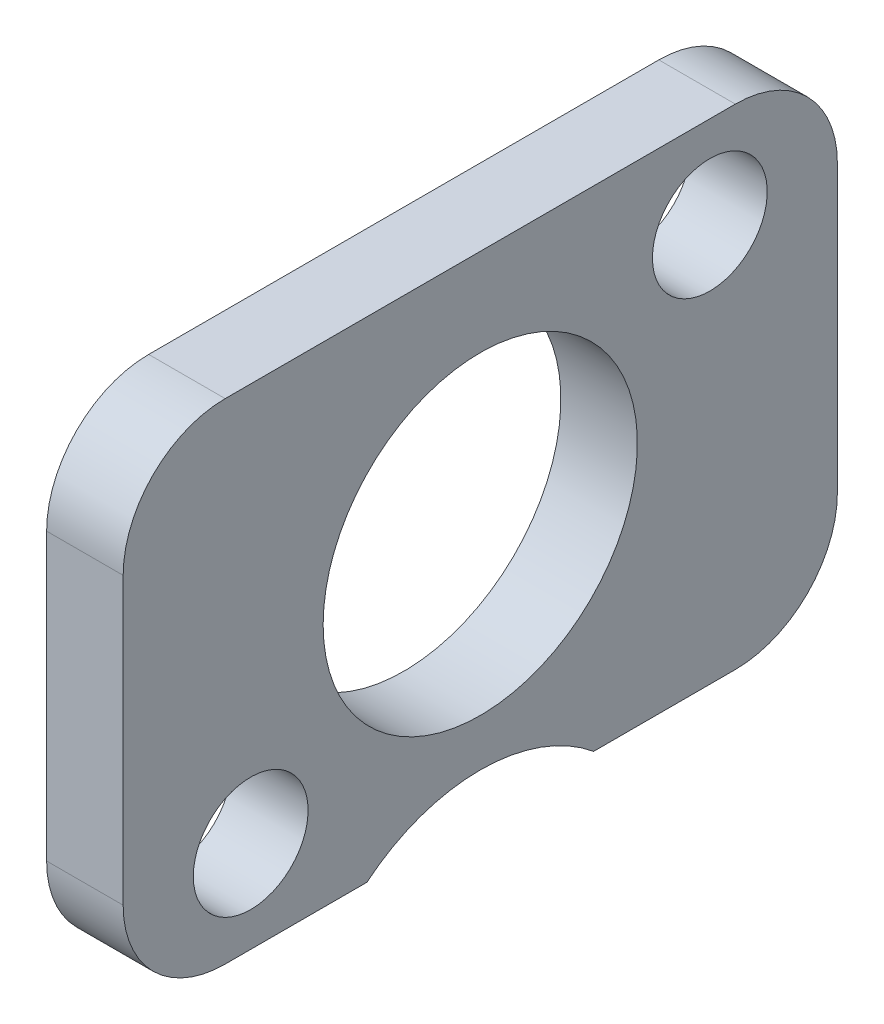
ISO-10303-21;
HEADER;
FILE_DESCRIPTION(('STEP AP214'),'2;1');
FILE_NAME('part.step','',(''),(''),'','','');
FILE_SCHEMA(('AUTOMOTIVE_DESIGN { 1 0 10303 214 1 1 1 1 }'));
ENDSEC;
DATA;
#1=APPLICATION_CONTEXT('core data for automotive mechanical design processes');
#2=APPLICATION_PROTOCOL_DEFINITION('international standard','automotive_design',2000,#1);
#3=PRODUCT_CONTEXT('',#1,'mechanical');
#4=PRODUCT('Part','Part','',(#3));
#5=PRODUCT_RELATED_PRODUCT_CATEGORY('part','',(#4));
#6=PRODUCT_DEFINITION_FORMATION('','',#4);
#7=PRODUCT_DEFINITION_CONTEXT('part definition',#1,'design');
#8=PRODUCT_DEFINITION('design','',#6,#7);
#9=PRODUCT_DEFINITION_SHAPE('','',#8);
#10=(LENGTH_UNIT() NAMED_UNIT(*) SI_UNIT(.MILLI.,.METRE.));
#11=(NAMED_UNIT(*) PLANE_ANGLE_UNIT() SI_UNIT($,.RADIAN.));
#12=(NAMED_UNIT(*) SI_UNIT($,.STERADIAN.) SOLID_ANGLE_UNIT());
#13=UNCERTAINTY_MEASURE_WITH_UNIT(LENGTH_MEASURE(1.E-05),#10,'distance_accuracy_value','');
#14=(GEOMETRIC_REPRESENTATION_CONTEXT(3) GLOBAL_UNCERTAINTY_ASSIGNED_CONTEXT((#13)) GLOBAL_UNIT_ASSIGNED_CONTEXT((#10,
#11,#12)) REPRESENTATION_CONTEXT('',''));
#15=CARTESIAN_POINT('',(0.,0.,0.));
#16=DIRECTION('',(0.,0.,1.));
#17=DIRECTION('',(1.,0.,0.));
#18=AXIS2_PLACEMENT_3D('',#15,#16,#17);
#19=CARTESIAN_POINT('',(2.38125,4.445,-7.9375));
#20=DIRECTION('',(-1.,0.,0.));
#21=DIRECTION('',(0.,0.,1.));
#22=AXIS2_PLACEMENT_3D('',#19,#20,#21);
#23=CYLINDRICAL_SURFACE('',#22,3.175);
#24=CARTESIAN_POINT('',(0.,4.445,-7.9375));
#25=DIRECTION('',(-1.,0.,0.));
#26=DIRECTION('',(0.,0.,1.));
#27=AXIS2_PLACEMENT_3D('',#24,#25,#26);
#28=CIRCLE('',#27,3.175);
#29=CARTESIAN_POINT('',(0.,7.62,-7.9375));
#30=VERTEX_POINT('',#29);
#31=CARTESIAN_POINT('',(0.,4.445,-11.1125));
#32=VERTEX_POINT('',#31);
#33=EDGE_CURVE('E436',#30,#32,#28,.T.);
#34=ORIENTED_EDGE('',*,*,#33,.F.);
#35=DIRECTION('',(-1.,0.,0.));
#36=VECTOR('',#35,1.);
#37=CARTESIAN_POINT('',(2.38125,7.62,-7.9375));
#38=LINE('',#37,#36);
#39=CARTESIAN_POINT('',(2.38125,7.62,-7.9375));
#40=VERTEX_POINT('',#39);
#41=EDGE_CURVE('E11',#40,#30,#38,.T.);
#42=ORIENTED_EDGE('',*,*,#41,.F.);
#43=CARTESIAN_POINT('',(2.38125,4.445,-7.9375));
#44=DIRECTION('',(-1.,0.,0.));
#45=DIRECTION('',(0.,0.,1.));
#46=AXIS2_PLACEMENT_3D('',#43,#44,#45);
#47=CIRCLE('',#46,3.175);
#48=CARTESIAN_POINT('',(2.38125,4.445,-11.1125));
#49=VERTEX_POINT('',#48);
#50=EDGE_CURVE('E438',#40,#49,#47,.T.);
#51=ORIENTED_EDGE('',*,*,#50,.T.);
#52=DIRECTION('',(-1.,0.,0.));
#53=VECTOR('',#52,1.);
#54=CARTESIAN_POINT('',(2.38125,4.445,-11.1125));
#55=LINE('',#54,#53);
#56=EDGE_CURVE('E363',#49,#32,#55,.T.);
#57=ORIENTED_EDGE('',*,*,#56,.T.);
#58=EDGE_LOOP('',(#34,#42,#51,#57));
#59=FACE_BOUND('',#58,.T.);
#60=ADVANCED_FACE('F360',(#59),#23,.T.);
#61=CARTESIAN_POINT('',(2.38125,7.62,7.9375));
#62=DIRECTION('',(0.,1.,0.));
#63=DIRECTION('',(0.,0.,1.));
#64=AXIS2_PLACEMENT_3D('',#61,#62,#63);
#65=PLANE('',#64);
#66=DIRECTION('',(0.,0.,-1.));
#67=VECTOR('',#66,1.);
#68=CARTESIAN_POINT('',(0.,7.62,7.9375));
#69=LINE('',#68,#67);
#70=CARTESIAN_POINT('',(0.,7.62,7.9375));
#71=VERTEX_POINT('',#70);
#72=EDGE_CURVE('E454',#71,#30,#69,.T.);
#73=ORIENTED_EDGE('',*,*,#72,.F.);
#74=DIRECTION('',(-1.,0.,0.));
#75=VECTOR('',#74,1.);
#76=CARTESIAN_POINT('',(2.38125,7.62,7.9375));
#77=LINE('',#76,#75);
#78=CARTESIAN_POINT('',(2.38125,7.62,7.9375));
#79=VERTEX_POINT('',#78);
#80=EDGE_CURVE('E368',#79,#71,#77,.T.);
#81=ORIENTED_EDGE('',*,*,#80,.F.);
#82=DIRECTION('',(0.,0.,-1.));
#83=VECTOR('',#82,1.);
#84=CARTESIAN_POINT('',(2.38125,7.62,7.9375));
#85=LINE('',#84,#83);
#86=EDGE_CURVE('E443',#79,#40,#85,.T.);
#87=ORIENTED_EDGE('',*,*,#86,.T.);
#88=ORIENTED_EDGE('',*,*,#41,.T.);
#89=EDGE_LOOP('',(#73,#81,#87,#88));
#90=FACE_BOUND('',#89,.T.);
#91=ADVANCED_FACE('F547',(#90),#65,.T.);
#92=CARTESIAN_POINT('',(2.38125,4.445,7.9375));
#93=DIRECTION('',(-1.,0.,0.));
#94=DIRECTION('',(0.,0.,1.));
#95=AXIS2_PLACEMENT_3D('',#92,#93,#94);
#96=CYLINDRICAL_SURFACE('',#95,3.175);
#97=CARTESIAN_POINT('',(0.,4.445,7.9375));
#98=DIRECTION('',(-1.,0.,0.));
#99=DIRECTION('',(0.,0.,1.));
#100=AXIS2_PLACEMENT_3D('',#97,#98,#99);
#101=CIRCLE('',#100,3.175);
#102=CARTESIAN_POINT('',(0.,4.445,11.1125));
#103=VERTEX_POINT('',#102);
#104=EDGE_CURVE('E478',#103,#71,#101,.T.);
#105=ORIENTED_EDGE('',*,*,#104,.F.);
#106=DIRECTION('',(-1.,0.,0.));
#107=VECTOR('',#106,1.);
#108=CARTESIAN_POINT('',(2.38125,4.445,11.1125));
#109=LINE('',#108,#107);
#110=CARTESIAN_POINT('',(2.38125,4.445,11.1125));
#111=VERTEX_POINT('',#110);
#112=EDGE_CURVE('E506',#111,#103,#109,.T.);
#113=ORIENTED_EDGE('',*,*,#112,.F.);
#114=CARTESIAN_POINT('',(2.38125,4.445,7.9375));
#115=DIRECTION('',(-1.,0.,0.));
#116=DIRECTION('',(0.,0.,1.));
#117=AXIS2_PLACEMENT_3D('',#114,#115,#116);
#118=CIRCLE('',#117,3.175);
#119=EDGE_CURVE('E502',#111,#79,#118,.T.);
#120=ORIENTED_EDGE('',*,*,#119,.T.);
#121=ORIENTED_EDGE('',*,*,#80,.T.);
#122=EDGE_LOOP('',(#105,#113,#120,#121));
#123=FACE_BOUND('',#122,.T.);
#124=ADVANCED_FACE('F543',(#123),#96,.T.);
#125=CARTESIAN_POINT('',(2.38125,-4.445,11.1125));
#126=DIRECTION('',(0.,0.,1.));
#127=DIRECTION('',(0.,-1.,0.));
#128=AXIS2_PLACEMENT_3D('',#125,#126,#127);
#129=PLANE('',#128);
#130=DIRECTION('',(0.,1.,0.));
#131=VECTOR('',#130,1.);
#132=CARTESIAN_POINT('',(0.,-4.445,11.1125));
#133=LINE('',#132,#131);
#134=CARTESIAN_POINT('',(0.,-4.445,11.1125));
#135=VERTEX_POINT('',#134);
#136=EDGE_CURVE('E475',#135,#103,#133,.T.);
#137=ORIENTED_EDGE('',*,*,#136,.F.);
#138=DIRECTION('',(-1.,0.,0.));
#139=VECTOR('',#138,1.);
#140=CARTESIAN_POINT('',(2.38125,-4.445,11.1125));
#141=LINE('',#140,#139);
#142=CARTESIAN_POINT('',(2.38125,-4.445,11.1125));
#143=VERTEX_POINT('',#142);
#144=EDGE_CURVE('E508',#143,#135,#141,.T.);
#145=ORIENTED_EDGE('',*,*,#144,.F.);
#146=DIRECTION('',(0.,1.,0.));
#147=VECTOR('',#146,1.);
#148=CARTESIAN_POINT('',(2.38125,-4.445,11.1125));
#149=LINE('',#148,#147);
#150=EDGE_CURVE('E499',#143,#111,#149,.T.);
#151=ORIENTED_EDGE('',*,*,#150,.T.);
#152=ORIENTED_EDGE('',*,*,#112,.T.);
#153=EDGE_LOOP('',(#137,#145,#151,#152));
#154=FACE_BOUND('',#153,.T.);
#155=ADVANCED_FACE('F539',(#154),#129,.T.);
#156=CARTESIAN_POINT('',(2.38125,-4.445,7.9375));
#157=DIRECTION('',(-1.,0.,0.));
#158=DIRECTION('',(0.,0.,1.));
#159=AXIS2_PLACEMENT_3D('',#156,#157,#158);
#160=CYLINDRICAL_SURFACE('',#159,3.175);
#161=CARTESIAN_POINT('',(0.,-4.445,7.9375));
#162=DIRECTION('',(-1.,0.,0.));
#163=DIRECTION('',(0.,0.,-1.));
#164=AXIS2_PLACEMENT_3D('',#161,#162,#163);
#165=CIRCLE('',#164,3.175);
#166=CARTESIAN_POINT('',(0.,-7.62,7.9375));
#167=VERTEX_POINT('',#166);
#168=EDGE_CURVE('E472',#167,#135,#165,.T.);
#169=ORIENTED_EDGE('',*,*,#168,.F.);
#170=DIRECTION('',(-1.,0.,0.));
#171=VECTOR('',#170,1.);
#172=CARTESIAN_POINT('',(2.38125,-7.62,7.9375));
#173=LINE('',#172,#171);
#174=CARTESIAN_POINT('',(2.38125,-7.62,7.9375));
#175=VERTEX_POINT('',#174);
#176=EDGE_CURVE('E510',#175,#167,#173,.T.);
#177=ORIENTED_EDGE('',*,*,#176,.F.);
#178=CARTESIAN_POINT('',(2.38125,-4.445,7.9375));
#179=DIRECTION('',(-1.,0.,0.));
#180=DIRECTION('',(0.,0.,-1.));
#181=AXIS2_PLACEMENT_3D('',#178,#179,#180);
#182=CIRCLE('',#181,3.175);
#183=EDGE_CURVE('E496',#175,#143,#182,.T.);
#184=ORIENTED_EDGE('',*,*,#183,.T.);
#185=ORIENTED_EDGE('',*,*,#144,.T.);
#186=EDGE_LOOP('',(#169,#177,#184,#185));
#187=FACE_BOUND('',#186,.T.);
#188=ADVANCED_FACE('F535',(#187),#160,.T.);
#189=CARTESIAN_POINT('',(2.38125,-7.62,7.9375));
#190=DIRECTION('',(0.,-1.,0.));
#191=DIRECTION('',(0.,0.,-1.));
#192=AXIS2_PLACEMENT_3D('',#189,#190,#191);
#193=PLANE('',#192);
#194=DIRECTION('',(0.,0.,1.));
#195=VECTOR('',#194,1.);
#196=CARTESIAN_POINT('',(0.,-7.62,7.9375));
#197=LINE('',#196,#195);
#198=CARTESIAN_POINT('',(0.,-7.62,3.52781792366047));
#199=VERTEX_POINT('',#198);
#200=EDGE_CURVE('E469',#199,#167,#197,.T.);
#201=ORIENTED_EDGE('',*,*,#200,.F.);
#202=DIRECTION('',(-1.,0.,0.));
#203=VECTOR('',#202,1.);
#204=CARTESIAN_POINT('',(2.38125,-7.62,3.52781792366047));
#205=LINE('',#204,#203);
#206=CARTESIAN_POINT('',(2.38125,-7.62,3.52781792366047));
#207=VERTEX_POINT('',#206);
#208=EDGE_CURVE('E512',#207,#199,#205,.T.);
#209=ORIENTED_EDGE('',*,*,#208,.F.);
#210=DIRECTION('',(0.,0.,1.));
#211=VECTOR('',#210,1.);
#212=CARTESIAN_POINT('',(2.38125,-7.62,7.9375));
#213=LINE('',#212,#211);
#214=EDGE_CURVE('E493',#207,#175,#213,.T.);
#215=ORIENTED_EDGE('',*,*,#214,.T.);
#216=ORIENTED_EDGE('',*,*,#176,.T.);
#217=EDGE_LOOP('',(#201,#209,#215,#216));
#218=FACE_BOUND('',#217,.T.);
#219=ADVANCED_FACE('F531',(#218),#193,.T.);
#220=CARTESIAN_POINT('',(2.38125,-11.9126,0.));
#221=DIRECTION('',(-1.,0.,0.));
#222=DIRECTION('',(0.,0.,1.));
#223=AXIS2_PLACEMENT_3D('',#220,#221,#222);
#224=CYLINDRICAL_SURFACE('',#223,5.55625);
#225=CARTESIAN_POINT('',(0.,-11.9126,0.));
#226=DIRECTION('',(1.,0.,0.));
#227=DIRECTION('',(0.,0.,1.));
#228=AXIS2_PLACEMENT_3D('',#225,#226,#227);
#229=CIRCLE('',#228,5.55625);
#230=CARTESIAN_POINT('',(0.,-7.62,-3.52781792366047));
#231=VERTEX_POINT('',#230);
#232=EDGE_CURVE('E466',#231,#199,#229,.T.);
#233=ORIENTED_EDGE('',*,*,#232,.F.);
#234=DIRECTION('',(-1.,0.,0.));
#235=VECTOR('',#234,1.);
#236=CARTESIAN_POINT('',(2.38125,-7.62,-3.52781792366047));
#237=LINE('',#236,#235);
#238=CARTESIAN_POINT('',(2.38125,-7.62,-3.52781792366047));
#239=VERTEX_POINT('',#238);
#240=EDGE_CURVE('E514',#239,#231,#237,.T.);
#241=ORIENTED_EDGE('',*,*,#240,.F.);
#242=CARTESIAN_POINT('',(2.38125,-11.9126,0.));
#243=DIRECTION('',(1.,0.,0.));
#244=DIRECTION('',(0.,0.,1.));
#245=AXIS2_PLACEMENT_3D('',#242,#243,#244);
#246=CIRCLE('',#245,5.55625);
#247=EDGE_CURVE('E490',#239,#207,#246,.T.);
#248=ORIENTED_EDGE('',*,*,#247,.T.);
#249=ORIENTED_EDGE('',*,*,#208,.T.);
#250=EDGE_LOOP('',(#233,#241,#248,#249));
#251=FACE_BOUND('',#250,.T.);
#252=ADVANCED_FACE('F527',(#251),#224,.F.);
#253=CARTESIAN_POINT('',(2.38125,-7.62,-3.52781792366047));
#254=DIRECTION('',(0.,-1.,0.));
#255=DIRECTION('',(0.,0.,-1.));
#256=AXIS2_PLACEMENT_3D('',#253,#254,#255);
#257=PLANE('',#256);
#258=DIRECTION('',(0.,0.,1.));
#259=VECTOR('',#258,1.);
#260=CARTESIAN_POINT('',(0.,-7.62,-3.52781792366047));
#261=LINE('',#260,#259);
#262=CARTESIAN_POINT('',(0.,-7.62,-7.9375));
#263=VERTEX_POINT('',#262);
#264=EDGE_CURVE('E463',#263,#231,#261,.T.);
#265=ORIENTED_EDGE('',*,*,#264,.F.);
#266=DIRECTION('',(-1.,0.,0.));
#267=VECTOR('',#266,1.);
#268=CARTESIAN_POINT('',(2.38125,-7.62,-7.9375));
#269=LINE('',#268,#267);
#270=CARTESIAN_POINT('',(2.38125,-7.62,-7.9375));
#271=VERTEX_POINT('',#270);
#272=EDGE_CURVE('E516',#271,#263,#269,.T.);
#273=ORIENTED_EDGE('',*,*,#272,.F.);
#274=DIRECTION('',(0.,0.,1.));
#275=VECTOR('',#274,1.);
#276=CARTESIAN_POINT('',(2.38125,-7.62,-3.52781792366047));
#277=LINE('',#276,#275);
#278=EDGE_CURVE('E487',#271,#239,#277,.T.);
#279=ORIENTED_EDGE('',*,*,#278,.T.);
#280=ORIENTED_EDGE('',*,*,#240,.T.);
#281=EDGE_LOOP('',(#265,#273,#279,#280));
#282=FACE_BOUND('',#281,.T.);
#283=ADVANCED_FACE('F523',(#282),#257,.T.);
#284=CARTESIAN_POINT('',(2.38125,-4.445,-7.9375));
#285=DIRECTION('',(-1.,0.,0.));
#286=DIRECTION('',(0.,0.,1.));
#287=AXIS2_PLACEMENT_3D('',#284,#285,#286);
#288=CYLINDRICAL_SURFACE('',#287,3.175);
#289=CARTESIAN_POINT('',(0.,-4.445,-7.9375));
#290=DIRECTION('',(-1.,0.,0.));
#291=DIRECTION('',(0.,0.,1.));
#292=AXIS2_PLACEMENT_3D('',#289,#290,#291);
#293=CIRCLE('',#292,3.175);
#294=CARTESIAN_POINT('',(0.,-4.445,-11.1125));
#295=VERTEX_POINT('',#294);
#296=EDGE_CURVE('E450',#295,#263,#293,.T.);
#297=ORIENTED_EDGE('',*,*,#296,.F.);
#298=DIRECTION('',(-1.,0.,0.));
#299=VECTOR('',#298,1.);
#300=CARTESIAN_POINT('',(2.38125,-4.445,-11.1125));
#301=LINE('',#300,#299);
#302=CARTESIAN_POINT('',(2.38125,-4.445,-11.1125));
#303=VERTEX_POINT('',#302);
#304=EDGE_CURVE('E442',#303,#295,#301,.T.);
#305=ORIENTED_EDGE('',*,*,#304,.F.);
#306=CARTESIAN_POINT('',(2.38125,-4.445,-7.9375));
#307=DIRECTION('',(-1.,0.,0.));
#308=DIRECTION('',(0.,0.,1.));
#309=AXIS2_PLACEMENT_3D('',#306,#307,#308);
#310=CIRCLE('',#309,3.175);
#311=EDGE_CURVE('E484',#303,#271,#310,.T.);
#312=ORIENTED_EDGE('',*,*,#311,.T.);
#313=ORIENTED_EDGE('',*,*,#272,.T.);
#314=EDGE_LOOP('',(#297,#305,#312,#313));
#315=FACE_BOUND('',#314,.T.);
#316=ADVANCED_FACE('F519',(#315),#288,.T.);
#317=CARTESIAN_POINT('',(2.38125,-4.445,-11.1125));
#318=DIRECTION('',(0.,0.,-1.));
#319=DIRECTION('',(0.,1.,0.));
#320=AXIS2_PLACEMENT_3D('',#317,#318,#319);
#321=PLANE('',#320);
#322=DIRECTION('',(0.,-1.,0.));
#323=VECTOR('',#322,1.);
#324=CARTESIAN_POINT('',(0.,-4.445,-11.1125));
#325=LINE('',#324,#323);
#326=EDGE_CURVE('E445',#32,#295,#325,.T.);
#327=ORIENTED_EDGE('',*,*,#326,.F.);
#328=ORIENTED_EDGE('',*,*,#56,.F.);
#329=DIRECTION('',(0.,-1.,0.));
#330=VECTOR('',#329,1.);
#331=CARTESIAN_POINT('',(2.38125,-4.445,-11.1125));
#332=LINE('',#331,#330);
#333=EDGE_CURVE('E482',#49,#303,#332,.T.);
#334=ORIENTED_EDGE('',*,*,#333,.T.);
#335=ORIENTED_EDGE('',*,*,#304,.T.);
#336=EDGE_LOOP('',(#327,#328,#334,#335));
#337=FACE_BOUND('',#336,.T.);
#338=ADVANCED_FACE('F446',(#337),#321,.T.);
#339=CARTESIAN_POINT('',(2.38125,4.445,-7.9375));
#340=DIRECTION('',(-1.,0.,0.));
#341=DIRECTION('',(0.,0.,1.));
#342=AXIS2_PLACEMENT_3D('',#339,#340,#341);
#343=PLANE('',#342);
#344=CARTESIAN_POINT('',(2.38125,-4.7625,7.14375));
#345=DIRECTION('',(-1.,0.,0.));
#346=DIRECTION('',(0.,0.,1.));
#347=AXIS2_PLACEMENT_3D('',#344,#345,#346);
#348=CIRCLE('',#347,1.7859375);
#349=CARTESIAN_POINT('',(2.38125,-4.7625,8.9296875));
#350=VERTEX_POINT('',#349);
#351=EDGE_CURVE('E582',#350,#350,#348,.T.);
#352=ORIENTED_EDGE('',*,*,#351,.T.);
#353=EDGE_LOOP('',(#352));
#354=FACE_BOUND('',#353,.T.);
#355=CARTESIAN_POINT('',(2.38125,4.7625,-7.14375));
#356=DIRECTION('',(-1.,0.,0.));
#357=DIRECTION('',(0.,0.,1.));
#358=AXIS2_PLACEMENT_3D('',#355,#356,#357);
#359=CIRCLE('',#358,1.7859375);
#360=CARTESIAN_POINT('',(2.38125,4.7625,-5.3578125));
#361=VERTEX_POINT('',#360);
#362=EDGE_CURVE('E586',#361,#361,#359,.T.);
#363=ORIENTED_EDGE('',*,*,#362,.T.);
#364=EDGE_LOOP('',(#363));
#365=FACE_BOUND('',#364,.T.);
#366=CARTESIAN_POINT('',(2.38125,0.,0.));
#367=DIRECTION('',(-1.,0.,0.));
#368=DIRECTION('',(0.,0.,1.));
#369=AXIS2_PLACEMENT_3D('',#366,#367,#368);
#370=CIRCLE('',#369,4.8895);
#371=CARTESIAN_POINT('',(2.38125,0.,4.88950000000001));
#372=VERTEX_POINT('',#371);
#373=EDGE_CURVE('E455',#372,#372,#370,.T.);
#374=ORIENTED_EDGE('',*,*,#373,.T.);
#375=EDGE_LOOP('',(#374));
#376=FACE_BOUND('',#375,.T.);
#377=ORIENTED_EDGE('',*,*,#50,.F.);
#378=ORIENTED_EDGE('',*,*,#86,.F.);
#379=ORIENTED_EDGE('',*,*,#119,.F.);
#380=ORIENTED_EDGE('',*,*,#150,.F.);
#381=ORIENTED_EDGE('',*,*,#183,.F.);
#382=ORIENTED_EDGE('',*,*,#214,.F.);
#383=ORIENTED_EDGE('',*,*,#247,.F.);
#384=ORIENTED_EDGE('',*,*,#278,.F.);
#385=ORIENTED_EDGE('',*,*,#311,.F.);
#386=ORIENTED_EDGE('',*,*,#333,.F.);
#387=EDGE_LOOP('',(#377,#378,#379,#380,#381,#382,#383,#384,#385,#386));
#388=FACE_BOUND('',#387,.T.);
#389=ADVANCED_FACE('F546',(#354,#365,#376,#388),#343,.F.);
#390=CARTESIAN_POINT('',(0.,4.445,-7.9375));
#391=DIRECTION('',(-1.,0.,0.));
#392=DIRECTION('',(0.,0.,1.));
#393=AXIS2_PLACEMENT_3D('',#390,#391,#392);
#394=PLANE('',#393);
#395=CARTESIAN_POINT('',(0.,-4.7625,7.14375));
#396=DIRECTION('',(-1.,0.,0.));
#397=DIRECTION('',(0.,0.,1.));
#398=AXIS2_PLACEMENT_3D('',#395,#396,#397);
#399=CIRCLE('',#398,1.7859375);
#400=CARTESIAN_POINT('',(0.,-4.7625,8.9296875));
#401=VERTEX_POINT('',#400);
#402=EDGE_CURVE('E602',#401,#401,#399,.T.);
#403=ORIENTED_EDGE('',*,*,#402,.F.);
#404=EDGE_LOOP('',(#403));
#405=FACE_BOUND('',#404,.T.);
#406=CARTESIAN_POINT('',(0.,4.7625,-7.14375));
#407=DIRECTION('',(-1.,0.,0.));
#408=DIRECTION('',(0.,0.,1.));
#409=AXIS2_PLACEMENT_3D('',#406,#407,#408);
#410=CIRCLE('',#409,1.7859375);
#411=CARTESIAN_POINT('',(0.,4.7625,-5.3578125));
#412=VERTEX_POINT('',#411);
#413=EDGE_CURVE('E596',#412,#412,#410,.T.);
#414=ORIENTED_EDGE('',*,*,#413,.F.);
#415=EDGE_LOOP('',(#414));
#416=FACE_BOUND('',#415,.T.);
#417=CARTESIAN_POINT('',(0.,0.,0.));
#418=DIRECTION('',(-1.,0.,0.));
#419=DIRECTION('',(0.,0.,1.));
#420=AXIS2_PLACEMENT_3D('',#417,#418,#419);
#421=CIRCLE('',#420,4.8895);
#422=CARTESIAN_POINT('',(0.,0.,4.88950000000001));
#423=VERTEX_POINT('',#422);
#424=EDGE_CURVE('E458',#423,#423,#421,.T.);
#425=ORIENTED_EDGE('',*,*,#424,.F.);
#426=EDGE_LOOP('',(#425));
#427=FACE_BOUND('',#426,.T.);
#428=ORIENTED_EDGE('',*,*,#33,.T.);
#429=ORIENTED_EDGE('',*,*,#326,.T.);
#430=ORIENTED_EDGE('',*,*,#296,.T.);
#431=ORIENTED_EDGE('',*,*,#264,.T.);
#432=ORIENTED_EDGE('',*,*,#232,.T.);
#433=ORIENTED_EDGE('',*,*,#200,.T.);
#434=ORIENTED_EDGE('',*,*,#168,.T.);
#435=ORIENTED_EDGE('',*,*,#136,.T.);
#436=ORIENTED_EDGE('',*,*,#104,.T.);
#437=ORIENTED_EDGE('',*,*,#72,.T.);
#438=EDGE_LOOP('',(#428,#429,#430,#431,#432,#433,#434,#435,#436,#437));
#439=FACE_BOUND('',#438,.T.);
#440=ADVANCED_FACE('F452',(#405,#416,#427,#439),#394,.T.);
#441=CARTESIAN_POINT('',(2.38125,0.,0.));
#442=DIRECTION('',(-1.,0.,0.));
#443=DIRECTION('',(0.,0.,1.));
#444=AXIS2_PLACEMENT_3D('',#441,#442,#443);
#445=CYLINDRICAL_SURFACE('',#444,4.8895);
#446=ORIENTED_EDGE('',*,*,#373,.F.);
#447=EDGE_LOOP('',(#446));
#448=FACE_BOUND('',#447,.T.);
#449=ORIENTED_EDGE('',*,*,#424,.T.);
#450=EDGE_LOOP('',(#449));
#451=FACE_BOUND('',#450,.T.);
#452=ADVANCED_FACE('F577',(#448,#451),#445,.F.);
#453=CARTESIAN_POINT('',(2.38125,4.7625,-7.14375));
#454=DIRECTION('',(-1.,0.,0.));
#455=DIRECTION('',(0.,0.,1.));
#456=AXIS2_PLACEMENT_3D('',#453,#454,#455);
#457=CYLINDRICAL_SURFACE('',#456,1.7859375);
#458=ORIENTED_EDGE('',*,*,#362,.F.);
#459=EDGE_LOOP('',(#458));
#460=FACE_BOUND('',#459,.T.);
#461=ORIENTED_EDGE('',*,*,#413,.T.);
#462=EDGE_LOOP('',(#461));
#463=FACE_BOUND('',#462,.T.);
#464=ADVANCED_FACE('F591',(#460,#463),#457,.F.);
#465=CARTESIAN_POINT('',(2.38125,-4.7625,7.14375));
#466=DIRECTION('',(-1.,0.,0.));
#467=DIRECTION('',(0.,0.,1.));
#468=AXIS2_PLACEMENT_3D('',#465,#466,#467);
#469=CYLINDRICAL_SURFACE('',#468,1.7859375);
#470=ORIENTED_EDGE('',*,*,#351,.F.);
#471=EDGE_LOOP('',(#470));
#472=FACE_BOUND('',#471,.T.);
#473=ORIENTED_EDGE('',*,*,#402,.T.);
#474=EDGE_LOOP('',(#473));
#475=FACE_BOUND('',#474,.T.);
#476=ADVANCED_FACE('F606',(#472,#475),#469,.F.);
#477=CLOSED_SHELL('',(#60,#91,#124,#155,#188,#219,#252,#283,#316,#338,#389,#440,#452,#464,#476));
#478=MANIFOLD_SOLID_BREP('B2',#477);
#479=ADVANCED_BREP_SHAPE_REPRESENTATION('',(#18,#478),#14);
#480=SHAPE_DEFINITION_REPRESENTATION(#9,#479);
ENDSEC;
END-ISO-10303-21;
